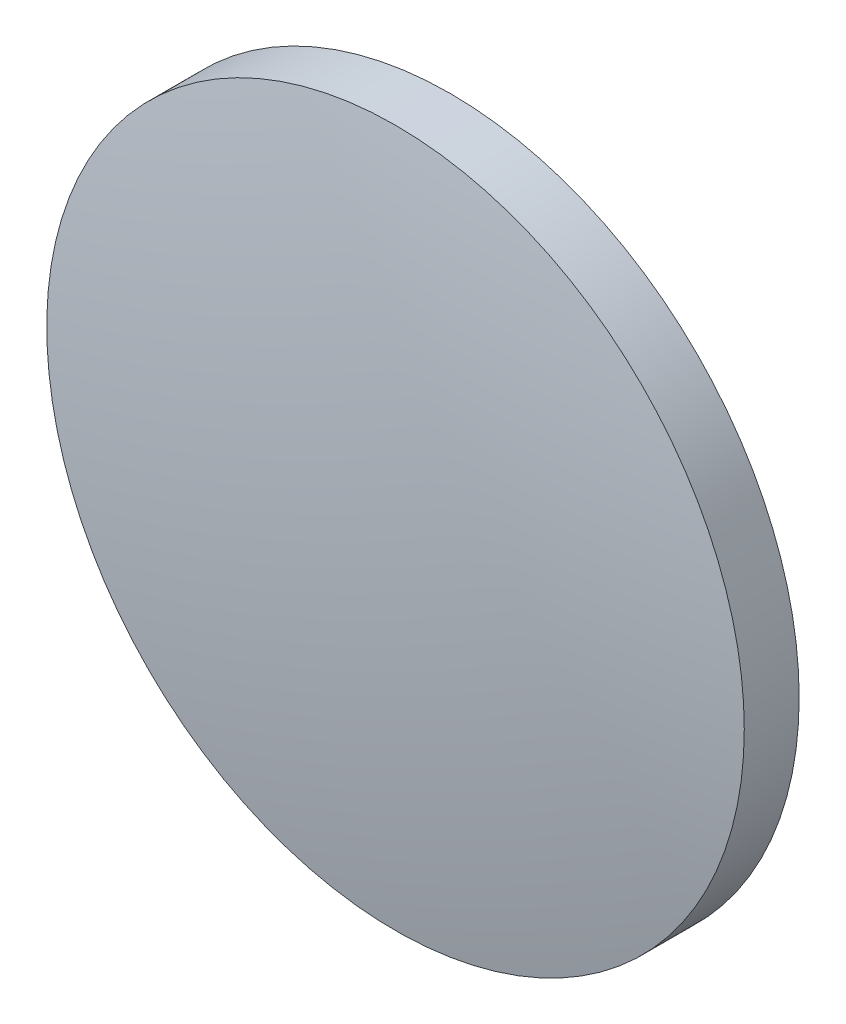
ISO-10303-21;
HEADER;
FILE_DESCRIPTION(('STEP AP214'),'2;1');
FILE_NAME('part.step','',(''),(''),'','','');
FILE_SCHEMA(('AUTOMOTIVE_DESIGN { 1 0 10303 214 1 1 1 1 }'));
ENDSEC;
DATA;
#1=APPLICATION_CONTEXT('core data for automotive mechanical design processes');
#2=APPLICATION_PROTOCOL_DEFINITION('international standard','automotive_design',2000,#1);
#3=PRODUCT_CONTEXT('',#1,'mechanical');
#4=PRODUCT('Part','Part','',(#3));
#5=PRODUCT_RELATED_PRODUCT_CATEGORY('part','',(#4));
#6=PRODUCT_DEFINITION_FORMATION('','',#4);
#7=PRODUCT_DEFINITION_CONTEXT('part definition',#1,'design');
#8=PRODUCT_DEFINITION('design','',#6,#7);
#9=PRODUCT_DEFINITION_SHAPE('','',#8);
#10=(LENGTH_UNIT() NAMED_UNIT(*) SI_UNIT(.MILLI.,.METRE.));
#11=(NAMED_UNIT(*) PLANE_ANGLE_UNIT() SI_UNIT($,.RADIAN.));
#12=(NAMED_UNIT(*) SI_UNIT($,.STERADIAN.) SOLID_ANGLE_UNIT());
#13=UNCERTAINTY_MEASURE_WITH_UNIT(LENGTH_MEASURE(1.E-05),#10,'distance_accuracy_value','');
#14=(GEOMETRIC_REPRESENTATION_CONTEXT(3) GLOBAL_UNCERTAINTY_ASSIGNED_CONTEXT((#13)) GLOBAL_UNIT_ASSIGNED_CONTEXT((#10,
#11,#12)) REPRESENTATION_CONTEXT('',''));
#15=CARTESIAN_POINT('',(0.,0.,0.));
#16=DIRECTION('',(0.,0.,1.));
#17=DIRECTION('',(1.,0.,0.));
#18=AXIS2_PLACEMENT_3D('',#15,#16,#17);
#19=CARTESIAN_POINT('',(0.,0.,74.49));
#20=DIRECTION('',(0.,0.,1.));
#21=DIRECTION('',(0.,1.,0.));
#22=AXIS2_PLACEMENT_3D('',#19,#20,#21);
#23=SPHERICAL_SURFACE('',#22,76.55);
#24=CARTESIAN_POINT('',(0.,0.,-0.999154850216734));
#25=DIRECTION('',(0.,0.,1.));
#26=DIRECTION('',(1.,0.,0.));
#27=AXIS2_PLACEMENT_3D('',#24,#25,#26);
#28=CIRCLE('',#27,12.7);
#29=CARTESIAN_POINT('',(12.7,0.,-0.999154850216734));
#30=VERTEX_POINT('',#29);
#31=EDGE_CURVE('E8',#30,#30,#28,.T.);
#32=ORIENTED_EDGE('',*,*,#31,.F.);
#33=EDGE_LOOP('',(#32));
#34=FACE_BOUND('',#33,.T.);
#35=ADVANCED_FACE('F12',(#34),#23,.T.);
#36=CARTESIAN_POINT('',(0.,0.,6.49100038893206));
#37=DIRECTION('',(0.,0.,1.));
#38=DIRECTION('',(1.,0.,0.));
#39=AXIS2_PLACEMENT_3D('',#36,#37,#38);
#40=CYLINDRICAL_SURFACE('',#39,12.7);
#41=CARTESIAN_POINT('',(0.,0.,0.999154850216732));
#42=DIRECTION('',(0.,0.,1.));
#43=DIRECTION('',(1.,0.,0.));
#44=AXIS2_PLACEMENT_3D('',#41,#42,#43);
#45=CIRCLE('',#44,12.7);
#46=CARTESIAN_POINT('',(12.7,0.,0.999154850216732));
#47=VERTEX_POINT('',#46);
#48=EDGE_CURVE('E18',#47,#47,#45,.T.);
#49=ORIENTED_EDGE('',*,*,#48,.F.);
#50=EDGE_LOOP('',(#49));
#51=FACE_BOUND('',#50,.T.);
#52=ORIENTED_EDGE('',*,*,#31,.T.);
#53=EDGE_LOOP('',(#52));
#54=FACE_BOUND('',#53,.T.);
#55=ADVANCED_FACE('F26',(#51,#54),#40,.T.);
#56=CARTESIAN_POINT('',(0.,0.,-74.49));
#57=DIRECTION('',(0.,0.,1.));
#58=DIRECTION('',(0.,1.,0.));
#59=AXIS2_PLACEMENT_3D('',#56,#57,#58);
#60=SPHERICAL_SURFACE('',#59,76.55);
#61=ORIENTED_EDGE('',*,*,#48,.T.);
#62=EDGE_LOOP('',(#61));
#63=FACE_BOUND('',#62,.T.);
#64=ADVANCED_FACE('F24',(#63),#60,.T.);
#65=CLOSED_SHELL('',(#35,#55,#64));
#66=MANIFOLD_SOLID_BREP('B1',#65);
#67=ADVANCED_BREP_SHAPE_REPRESENTATION('',(#18,#66),#14);
#68=SHAPE_DEFINITION_REPRESENTATION(#9,#67);
ENDSEC;
END-ISO-10303-21;
